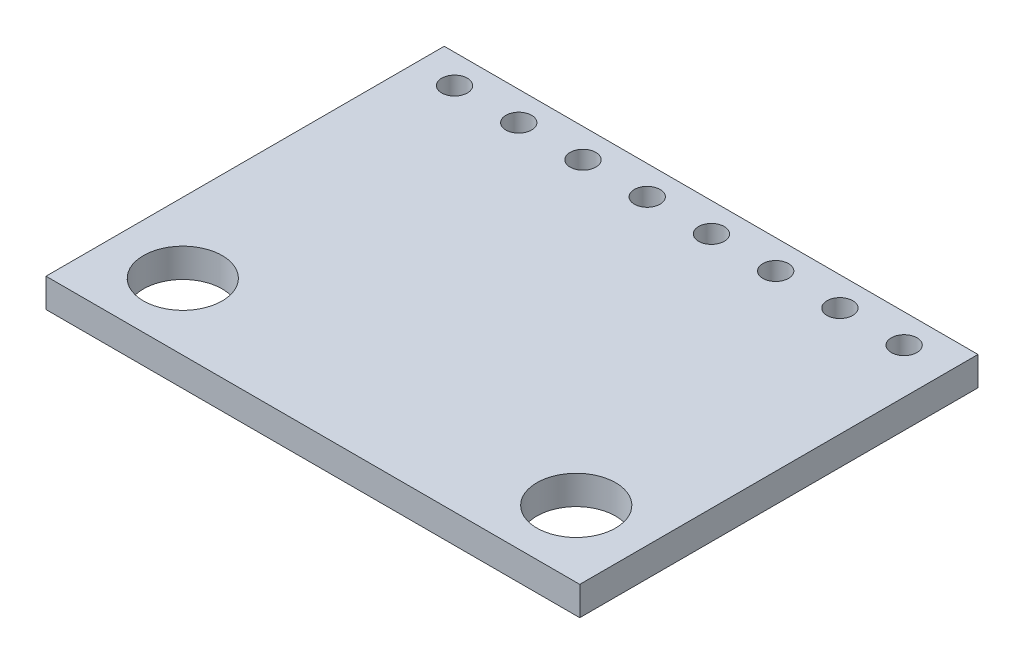
ISO-10303-21;
HEADER;
FILE_DESCRIPTION(('STEP AP214'),'2;1');
FILE_NAME('part.step','',(''),(''),'','','');
FILE_SCHEMA(('AUTOMOTIVE_DESIGN { 1 0 10303 214 1 1 1 1 }'));
ENDSEC;
DATA;
#1=APPLICATION_CONTEXT('core data for automotive mechanical design processes');
#2=APPLICATION_PROTOCOL_DEFINITION('international standard','automotive_design',2000,#1);
#3=PRODUCT_CONTEXT('',#1,'mechanical');
#4=PRODUCT('Part','Part','',(#3));
#5=PRODUCT_RELATED_PRODUCT_CATEGORY('part','',(#4));
#6=PRODUCT_DEFINITION_FORMATION('','',#4);
#7=PRODUCT_DEFINITION_CONTEXT('part definition',#1,'design');
#8=PRODUCT_DEFINITION('design','',#6,#7);
#9=PRODUCT_DEFINITION_SHAPE('','',#8);
#10=(LENGTH_UNIT() NAMED_UNIT(*) SI_UNIT(.MILLI.,.METRE.));
#11=(NAMED_UNIT(*) PLANE_ANGLE_UNIT() SI_UNIT($,.RADIAN.));
#12=(NAMED_UNIT(*) SI_UNIT($,.STERADIAN.) SOLID_ANGLE_UNIT());
#13=UNCERTAINTY_MEASURE_WITH_UNIT(LENGTH_MEASURE(1.E-05),#10,'distance_accuracy_value','');
#14=(GEOMETRIC_REPRESENTATION_CONTEXT(3) GLOBAL_UNCERTAINTY_ASSIGNED_CONTEXT((#13)) GLOBAL_UNIT_ASSIGNED_CONTEXT((#10,
#11,#12)) REPRESENTATION_CONTEXT('',''));
#15=CARTESIAN_POINT('',(0.,0.,0.));
#16=DIRECTION('',(0.,0.,1.));
#17=DIRECTION('',(1.,0.,0.));
#18=AXIS2_PLACEMENT_3D('',#15,#16,#17);
#19=CARTESIAN_POINT('',(0.,0.571499999999989,0.));
#20=DIRECTION('',(0.,-1.,0.));
#21=DIRECTION('',(0.,0.,-1.));
#22=AXIS2_PLACEMENT_3D('',#19,#20,#21);
#23=PLANE('',#22);
#24=CARTESIAN_POINT('',(6.2357,0.571499999999989,-6.73100000000001));
#25=DIRECTION('',(0.,1.,0.));
#26=DIRECTION('',(0.,0.,1.));
#27=AXIS2_PLACEMENT_3D('',#24,#25,#26);
#28=CIRCLE('',#27,0.508);
#29=CARTESIAN_POINT('',(6.2357,0.571499999999989,-6.22300000000001));
#30=VERTEX_POINT('',#29);
#31=EDGE_CURVE('E168',#30,#30,#28,.T.);
#32=ORIENTED_EDGE('',*,*,#31,.F.);
#33=EDGE_LOOP('',(#32));
#34=FACE_BOUND('',#33,.T.);
#35=CARTESIAN_POINT('',(1.1557,0.571499999999989,-6.73100000000001));
#36=DIRECTION('',(0.,1.,0.));
#37=DIRECTION('',(0.,0.,1.));
#38=AXIS2_PLACEMENT_3D('',#35,#36,#37);
#39=CIRCLE('',#38,0.508);
#40=CARTESIAN_POINT('',(1.1557,0.571499999999989,-6.22300000000001));
#41=VERTEX_POINT('',#40);
#42=EDGE_CURVE('E156',#41,#41,#39,.T.);
#43=ORIENTED_EDGE('',*,*,#42,.F.);
#44=EDGE_LOOP('',(#43));
#45=FACE_BOUND('',#44,.T.);
#46=CARTESIAN_POINT('',(-3.9243,0.571499999999989,-6.73100000000001));
#47=DIRECTION('',(0.,1.,0.));
#48=DIRECTION('',(0.,0.,1.));
#49=AXIS2_PLACEMENT_3D('',#46,#47,#48);
#50=CIRCLE('',#49,0.508);
#51=CARTESIAN_POINT('',(-3.9243,0.571499999999989,-6.22300000000001));
#52=VERTEX_POINT('',#51);
#53=EDGE_CURVE('E144',#52,#52,#50,.T.);
#54=ORIENTED_EDGE('',*,*,#53,.F.);
#55=EDGE_LOOP('',(#54));
#56=FACE_BOUND('',#55,.T.);
#57=CARTESIAN_POINT('',(-9.00429999999999,0.571499999999989,-6.73100000000001));
#58=DIRECTION('',(0.,1.,0.));
#59=DIRECTION('',(0.,0.,1.));
#60=AXIS2_PLACEMENT_3D('',#57,#58,#59);
#61=CIRCLE('',#60,0.508);
#62=CARTESIAN_POINT('',(-9.00429999999999,0.571499999999989,-6.22300000000001));
#63=VERTEX_POINT('',#62);
#64=EDGE_CURVE('E132',#63,#63,#61,.T.);
#65=ORIENTED_EDGE('',*,*,#64,.F.);
#66=EDGE_LOOP('',(#65));
#67=FACE_BOUND('',#66,.T.);
#68=CARTESIAN_POINT('',(-7.77874999999998,0.571499999999989,5.23874999999999));
#69=DIRECTION('',(0.,1.,0.));
#70=DIRECTION('',(0.,0.,1.));
#71=AXIS2_PLACEMENT_3D('',#68,#69,#70);
#72=CIRCLE('',#71,1.55575);
#73=CARTESIAN_POINT('',(-7.77874999999998,0.571499999999989,6.79449999999999));
#74=VERTEX_POINT('',#73);
#75=EDGE_CURVE('E111',#74,#74,#72,.T.);
#76=ORIENTED_EDGE('',*,*,#75,.F.);
#77=EDGE_LOOP('',(#76));
#78=FACE_BOUND('',#77,.T.);
#79=DIRECTION('',(0.,0.,-1.));
#80=VECTOR('',#79,1.);
#81=CARTESIAN_POINT('',(10.5537,0.571500000000003,7.87399999999998));
#82=LINE('',#81,#80);
#83=CARTESIAN_POINT('',(10.5537,0.571500000000003,7.87399999999998));
#84=VERTEX_POINT('',#83);
#85=CARTESIAN_POINT('',(10.5537,0.571499999999989,-7.87399999999999));
#86=VERTEX_POINT('',#85);
#87=EDGE_CURVE('E96',#84,#86,#82,.T.);
#88=ORIENTED_EDGE('',*,*,#87,.T.);
#89=DIRECTION('',(-1.,0.,0.));
#90=VECTOR('',#89,1.);
#91=CARTESIAN_POINT('',(-10.5537,0.571500000000003,-7.87400000000001));
#92=LINE('',#91,#90);
#93=CARTESIAN_POINT('',(-10.5537,0.571500000000003,-7.87400000000001));
#94=VERTEX_POINT('',#93);
#95=EDGE_CURVE('E91',#86,#94,#92,.T.);
#96=ORIENTED_EDGE('',*,*,#95,.T.);
#97=DIRECTION('',(0.,0.,1.));
#98=VECTOR('',#97,1.);
#99=CARTESIAN_POINT('',(-10.5537,0.571500000000003,7.87399999999998));
#100=LINE('',#99,#98);
#101=CARTESIAN_POINT('',(-10.5537,0.571500000000003,7.87399999999998));
#102=VERTEX_POINT('',#101);
#103=EDGE_CURVE('E94',#94,#102,#100,.T.);
#104=ORIENTED_EDGE('',*,*,#103,.T.);
#105=DIRECTION('',(1.,0.,0.));
#106=VECTOR('',#105,1.);
#107=CARTESIAN_POINT('',(-10.5537,0.571500000000003,7.87399999999998));
#108=LINE('',#107,#106);
#109=EDGE_CURVE('E61',#102,#84,#108,.T.);
#110=ORIENTED_EDGE('',*,*,#109,.T.);
#111=EDGE_LOOP('',(#88,#96,#104,#110));
#112=FACE_BOUND('',#111,.T.);
#113=CARTESIAN_POINT('',(7.77874999999999,0.571499999999989,5.23874999999999));
#114=DIRECTION('',(0.,1.,0.));
#115=DIRECTION('',(0.,0.,-1.));
#116=AXIS2_PLACEMENT_3D('',#113,#114,#115);
#117=CIRCLE('',#116,1.55575);
#118=CARTESIAN_POINT('',(7.77874999999999,0.571499999999989,3.68299999999999));
#119=VERTEX_POINT('',#118);
#120=EDGE_CURVE('E126',#119,#119,#117,.T.);
#121=ORIENTED_EDGE('',*,*,#120,.F.);
#122=EDGE_LOOP('',(#121));
#123=FACE_BOUND('',#122,.T.);
#124=CARTESIAN_POINT('',(-6.46429999999999,0.571499999999989,-6.73100000000001));
#125=DIRECTION('',(0.,1.,0.));
#126=DIRECTION('',(0.,0.,1.));
#127=AXIS2_PLACEMENT_3D('',#124,#125,#126);
#128=CIRCLE('',#127,0.508);
#129=CARTESIAN_POINT('',(-6.46429999999999,0.571499999999989,-6.22300000000001));
#130=VERTEX_POINT('',#129);
#131=EDGE_CURVE('E138',#130,#130,#128,.T.);
#132=ORIENTED_EDGE('',*,*,#131,.F.);
#133=EDGE_LOOP('',(#132));
#134=FACE_BOUND('',#133,.T.);
#135=CARTESIAN_POINT('',(-1.3843,0.571499999999989,-6.73100000000001));
#136=DIRECTION('',(0.,1.,0.));
#137=DIRECTION('',(0.,0.,1.));
#138=AXIS2_PLACEMENT_3D('',#135,#136,#137);
#139=CIRCLE('',#138,0.508);
#140=CARTESIAN_POINT('',(-1.3843,0.571499999999989,-6.22300000000001));
#141=VERTEX_POINT('',#140);
#142=EDGE_CURVE('E150',#141,#141,#139,.T.);
#143=ORIENTED_EDGE('',*,*,#142,.F.);
#144=EDGE_LOOP('',(#143));
#145=FACE_BOUND('',#144,.T.);
#146=CARTESIAN_POINT('',(3.6957,0.571499999999989,-6.73100000000001));
#147=DIRECTION('',(0.,1.,0.));
#148=DIRECTION('',(0.,0.,1.));
#149=AXIS2_PLACEMENT_3D('',#146,#147,#148);
#150=CIRCLE('',#149,0.508);
#151=CARTESIAN_POINT('',(3.6957,0.571499999999989,-6.22300000000001));
#152=VERTEX_POINT('',#151);
#153=EDGE_CURVE('E162',#152,#152,#150,.T.);
#154=ORIENTED_EDGE('',*,*,#153,.F.);
#155=EDGE_LOOP('',(#154));
#156=FACE_BOUND('',#155,.T.);
#157=CARTESIAN_POINT('',(8.7757,0.571499999999989,-6.73100000000001));
#158=DIRECTION('',(0.,1.,0.));
#159=DIRECTION('',(0.,0.,1.));
#160=AXIS2_PLACEMENT_3D('',#157,#158,#159);
#161=CIRCLE('',#160,0.508);
#162=CARTESIAN_POINT('',(8.7757,0.571499999999989,-6.22300000000001));
#163=VERTEX_POINT('',#162);
#164=EDGE_CURVE('E174',#163,#163,#161,.T.);
#165=ORIENTED_EDGE('',*,*,#164,.F.);
#166=EDGE_LOOP('',(#165));
#167=FACE_BOUND('',#166,.T.);
#168=ADVANCED_FACE('F44',(#34,#45,#56,#67,#78,#112,#123,#134,#145,#156,#167),#23,.F.);
#169=CARTESIAN_POINT('',(0.,-0.571500000000003,0.));
#170=DIRECTION('',(0.,-1.,0.));
#171=DIRECTION('',(0.,0.,-1.));
#172=AXIS2_PLACEMENT_3D('',#169,#170,#171);
#173=PLANE('',#172);
#174=CARTESIAN_POINT('',(6.2357,-0.571500000000003,-6.73100000000001));
#175=DIRECTION('',(0.,1.,0.));
#176=DIRECTION('',(0.,0.,1.));
#177=AXIS2_PLACEMENT_3D('',#174,#175,#176);
#178=CIRCLE('',#177,0.508);
#179=CARTESIAN_POINT('',(6.2357,-0.571500000000003,-6.22300000000001));
#180=VERTEX_POINT('',#179);
#181=EDGE_CURVE('E171',#180,#180,#178,.T.);
#182=ORIENTED_EDGE('',*,*,#181,.T.);
#183=EDGE_LOOP('',(#182));
#184=FACE_BOUND('',#183,.T.);
#185=CARTESIAN_POINT('',(1.1557,-0.571500000000003,-6.73100000000003));
#186=DIRECTION('',(0.,1.,0.));
#187=DIRECTION('',(0.,0.,1.));
#188=AXIS2_PLACEMENT_3D('',#185,#186,#187);
#189=CIRCLE('',#188,0.508);
#190=CARTESIAN_POINT('',(1.1557,-0.571500000000003,-6.22300000000003));
#191=VERTEX_POINT('',#190);
#192=EDGE_CURVE('E159',#191,#191,#189,.T.);
#193=ORIENTED_EDGE('',*,*,#192,.T.);
#194=EDGE_LOOP('',(#193));
#195=FACE_BOUND('',#194,.T.);
#196=CARTESIAN_POINT('',(-3.9243,-0.571500000000003,-6.73100000000003));
#197=DIRECTION('',(0.,1.,0.));
#198=DIRECTION('',(0.,0.,1.));
#199=AXIS2_PLACEMENT_3D('',#196,#197,#198);
#200=CIRCLE('',#199,0.508);
#201=CARTESIAN_POINT('',(-3.9243,-0.571500000000003,-6.22300000000003));
#202=VERTEX_POINT('',#201);
#203=EDGE_CURVE('E147',#202,#202,#200,.T.);
#204=ORIENTED_EDGE('',*,*,#203,.T.);
#205=EDGE_LOOP('',(#204));
#206=FACE_BOUND('',#205,.T.);
#207=CARTESIAN_POINT('',(-9.00429999999999,-0.571500000000003,-6.73100000000003));
#208=DIRECTION('',(0.,1.,0.));
#209=DIRECTION('',(0.,0.,1.));
#210=AXIS2_PLACEMENT_3D('',#207,#208,#209);
#211=CIRCLE('',#210,0.508);
#212=CARTESIAN_POINT('',(-9.00429999999999,-0.571500000000003,-6.22300000000003));
#213=VERTEX_POINT('',#212);
#214=EDGE_CURVE('E135',#213,#213,#211,.T.);
#215=ORIENTED_EDGE('',*,*,#214,.T.);
#216=EDGE_LOOP('',(#215));
#217=FACE_BOUND('',#216,.T.);
#218=CARTESIAN_POINT('',(-7.77874999999998,-0.571500000000003,5.23874999999997));
#219=DIRECTION('',(0.,1.,0.));
#220=DIRECTION('',(0.,0.,1.));
#221=AXIS2_PLACEMENT_3D('',#218,#219,#220);
#222=CIRCLE('',#221,1.55575);
#223=CARTESIAN_POINT('',(-7.77874999999998,-0.571500000000003,6.79449999999997));
#224=VERTEX_POINT('',#223);
#225=EDGE_CURVE('E123',#224,#224,#222,.T.);
#226=ORIENTED_EDGE('',*,*,#225,.T.);
#227=EDGE_LOOP('',(#226));
#228=FACE_BOUND('',#227,.T.);
#229=DIRECTION('',(0.,0.,-1.));
#230=VECTOR('',#229,1.);
#231=CARTESIAN_POINT('',(10.5537,-0.571500000000003,7.87399999999999));
#232=LINE('',#231,#230);
#233=CARTESIAN_POINT('',(10.5537,-0.571500000000003,7.87399999999999));
#234=VERTEX_POINT('',#233);
#235=CARTESIAN_POINT('',(10.5537,-0.571500000000016,-7.87400000000002));
#236=VERTEX_POINT('',#235);
#237=EDGE_CURVE('E108',#234,#236,#232,.T.);
#238=ORIENTED_EDGE('',*,*,#237,.F.);
#239=DIRECTION('',(1.,0.,0.));
#240=VECTOR('',#239,1.);
#241=CARTESIAN_POINT('',(-10.5537,-0.571500000000003,7.87399999999998));
#242=LINE('',#241,#240);
#243=CARTESIAN_POINT('',(-10.5537,-0.571500000000003,7.87399999999998));
#244=VERTEX_POINT('',#243);
#245=EDGE_CURVE('E84',#244,#234,#242,.T.);
#246=ORIENTED_EDGE('',*,*,#245,.F.);
#247=DIRECTION('',(0.,0.,1.));
#248=VECTOR('',#247,1.);
#249=CARTESIAN_POINT('',(-10.5537,-0.571500000000003,7.87399999999998));
#250=LINE('',#249,#248);
#251=CARTESIAN_POINT('',(-10.5537,-0.571500000000016,-7.87400000000003));
#252=VERTEX_POINT('',#251);
#253=EDGE_CURVE('E78',#252,#244,#250,.T.);
#254=ORIENTED_EDGE('',*,*,#253,.F.);
#255=DIRECTION('',(-1.,0.,0.));
#256=VECTOR('',#255,1.);
#257=CARTESIAN_POINT('',(-10.5537,-0.571500000000016,-7.87400000000003));
#258=LINE('',#257,#256);
#259=EDGE_CURVE('E100',#236,#252,#258,.T.);
#260=ORIENTED_EDGE('',*,*,#259,.F.);
#261=EDGE_LOOP('',(#238,#246,#254,#260));
#262=FACE_BOUND('',#261,.T.);
#263=CARTESIAN_POINT('',(7.77874999999999,-0.571500000000003,5.23874999999999));
#264=DIRECTION('',(0.,1.,0.));
#265=DIRECTION('',(0.,0.,-1.));
#266=AXIS2_PLACEMENT_3D('',#263,#264,#265);
#267=CIRCLE('',#266,1.55575);
#268=CARTESIAN_POINT('',(7.77874999999999,-0.571500000000003,3.68299999999999));
#269=VERTEX_POINT('',#268);
#270=EDGE_CURVE('E129',#269,#269,#267,.T.);
#271=ORIENTED_EDGE('',*,*,#270,.T.);
#272=EDGE_LOOP('',(#271));
#273=FACE_BOUND('',#272,.T.);
#274=CARTESIAN_POINT('',(-6.46429999999999,-0.571500000000003,-6.73100000000003));
#275=DIRECTION('',(0.,1.,0.));
#276=DIRECTION('',(0.,0.,1.));
#277=AXIS2_PLACEMENT_3D('',#274,#275,#276);
#278=CIRCLE('',#277,0.508);
#279=CARTESIAN_POINT('',(-6.46429999999999,-0.571500000000003,-6.22300000000003));
#280=VERTEX_POINT('',#279);
#281=EDGE_CURVE('E141',#280,#280,#278,.T.);
#282=ORIENTED_EDGE('',*,*,#281,.T.);
#283=EDGE_LOOP('',(#282));
#284=FACE_BOUND('',#283,.T.);
#285=CARTESIAN_POINT('',(-1.3843,-0.571500000000003,-6.73100000000003));
#286=DIRECTION('',(0.,1.,0.));
#287=DIRECTION('',(0.,0.,1.));
#288=AXIS2_PLACEMENT_3D('',#285,#286,#287);
#289=CIRCLE('',#288,0.508);
#290=CARTESIAN_POINT('',(-1.3843,-0.571500000000003,-6.22300000000003));
#291=VERTEX_POINT('',#290);
#292=EDGE_CURVE('E153',#291,#291,#289,.T.);
#293=ORIENTED_EDGE('',*,*,#292,.T.);
#294=EDGE_LOOP('',(#293));
#295=FACE_BOUND('',#294,.T.);
#296=CARTESIAN_POINT('',(3.6957,-0.571500000000003,-6.73100000000003));
#297=DIRECTION('',(0.,1.,0.));
#298=DIRECTION('',(0.,0.,1.));
#299=AXIS2_PLACEMENT_3D('',#296,#297,#298);
#300=CIRCLE('',#299,0.508);
#301=CARTESIAN_POINT('',(3.6957,-0.571500000000003,-6.22300000000003));
#302=VERTEX_POINT('',#301);
#303=EDGE_CURVE('E165',#302,#302,#300,.T.);
#304=ORIENTED_EDGE('',*,*,#303,.T.);
#305=EDGE_LOOP('',(#304));
#306=FACE_BOUND('',#305,.T.);
#307=CARTESIAN_POINT('',(8.7757,-0.571500000000003,-6.73100000000001));
#308=DIRECTION('',(0.,1.,0.));
#309=DIRECTION('',(0.,0.,1.));
#310=AXIS2_PLACEMENT_3D('',#307,#308,#309);
#311=CIRCLE('',#310,0.508);
#312=CARTESIAN_POINT('',(8.7757,-0.571500000000003,-6.22300000000001));
#313=VERTEX_POINT('',#312);
#314=EDGE_CURVE('E177',#313,#313,#311,.T.);
#315=ORIENTED_EDGE('',*,*,#314,.T.);
#316=EDGE_LOOP('',(#315));
#317=FACE_BOUND('',#316,.T.);
#318=ADVANCED_FACE('F119',(#184,#195,#206,#217,#228,#262,#273,#284,#295,#306,#317),#173,.T.);
#319=CARTESIAN_POINT('',(10.5537,0.571500000000003,7.87399999999998));
#320=DIRECTION('',(-1.,0.,0.));
#321=DIRECTION('',(0.,0.,1.));
#322=AXIS2_PLACEMENT_3D('',#319,#320,#321);
#323=PLANE('',#322);
#324=ORIENTED_EDGE('',*,*,#237,.T.);
#325=DIRECTION('',(0.,-1.,0.));
#326=VECTOR('',#325,1.);
#327=CARTESIAN_POINT('',(10.5537,0.571499999999989,-7.87399999999999));
#328=LINE('',#327,#326);
#329=EDGE_CURVE('E13',#86,#236,#328,.T.);
#330=ORIENTED_EDGE('',*,*,#329,.F.);
#331=ORIENTED_EDGE('',*,*,#87,.F.);
#332=DIRECTION('',(0.,-1.,0.));
#333=VECTOR('',#332,1.);
#334=CARTESIAN_POINT('',(10.5537,0.571500000000003,7.87399999999998));
#335=LINE('',#334,#333);
#336=EDGE_CURVE('E104',#84,#234,#335,.T.);
#337=ORIENTED_EDGE('',*,*,#336,.T.);
#338=EDGE_LOOP('',(#324,#330,#331,#337));
#339=FACE_BOUND('',#338,.T.);
#340=ADVANCED_FACE('F46',(#339),#323,.F.);
#341=CARTESIAN_POINT('',(-10.5537,0.571500000000003,-7.87400000000001));
#342=DIRECTION('',(0.,0.,1.));
#343=DIRECTION('',(1.,0.,0.));
#344=AXIS2_PLACEMENT_3D('',#341,#342,#343);
#345=PLANE('',#344);
#346=ORIENTED_EDGE('',*,*,#259,.T.);
#347=DIRECTION('',(0.,-1.,0.));
#348=VECTOR('',#347,1.);
#349=CARTESIAN_POINT('',(-10.5537,0.571500000000003,-7.87400000000001));
#350=LINE('',#349,#348);
#351=EDGE_CURVE('E53',#94,#252,#350,.T.);
#352=ORIENTED_EDGE('',*,*,#351,.F.);
#353=ORIENTED_EDGE('',*,*,#95,.F.);
#354=ORIENTED_EDGE('',*,*,#329,.T.);
#355=EDGE_LOOP('',(#346,#352,#353,#354));
#356=FACE_BOUND('',#355,.T.);
#357=ADVANCED_FACE('F99',(#356),#345,.F.);
#358=CARTESIAN_POINT('',(-10.5537,0.571500000000003,7.87399999999998));
#359=DIRECTION('',(1.,0.,0.));
#360=DIRECTION('',(0.,0.,-1.));
#361=AXIS2_PLACEMENT_3D('',#358,#359,#360);
#362=PLANE('',#361);
#363=ORIENTED_EDGE('',*,*,#253,.T.);
#364=DIRECTION('',(0.,-1.,0.));
#365=VECTOR('',#364,1.);
#366=CARTESIAN_POINT('',(-10.5537,0.571500000000003,7.87399999999998));
#367=LINE('',#366,#365);
#368=EDGE_CURVE('E101',#102,#244,#367,.T.);
#369=ORIENTED_EDGE('',*,*,#368,.F.);
#370=ORIENTED_EDGE('',*,*,#103,.F.);
#371=ORIENTED_EDGE('',*,*,#351,.T.);
#372=EDGE_LOOP('',(#363,#369,#370,#371));
#373=FACE_BOUND('',#372,.T.);
#374=ADVANCED_FACE('F102',(#373),#362,.F.);
#375=CARTESIAN_POINT('',(-10.5537,0.571500000000003,7.87399999999998));
#376=DIRECTION('',(0.,0.,-1.));
#377=DIRECTION('',(-1.,0.,0.));
#378=AXIS2_PLACEMENT_3D('',#375,#376,#377);
#379=PLANE('',#378);
#380=ORIENTED_EDGE('',*,*,#245,.T.);
#381=ORIENTED_EDGE('',*,*,#336,.F.);
#382=ORIENTED_EDGE('',*,*,#109,.F.);
#383=ORIENTED_EDGE('',*,*,#368,.T.);
#384=EDGE_LOOP('',(#380,#381,#382,#383));
#385=FACE_BOUND('',#384,.T.);
#386=ADVANCED_FACE('F116',(#385),#379,.F.);
#387=CARTESIAN_POINT('',(-7.77874999999998,0.571499999999989,5.23874999999999));
#388=DIRECTION('',(0.,-1.,0.));
#389=DIRECTION('',(0.,0.,-1.));
#390=AXIS2_PLACEMENT_3D('',#387,#388,#389);
#391=CYLINDRICAL_SURFACE('',#390,1.55575);
#392=ORIENTED_EDGE('',*,*,#75,.T.);
#393=EDGE_LOOP('',(#392));
#394=FACE_BOUND('',#393,.T.);
#395=ORIENTED_EDGE('',*,*,#225,.F.);
#396=EDGE_LOOP('',(#395));
#397=FACE_BOUND('',#396,.T.);
#398=ADVANCED_FACE('F197',(#394,#397),#391,.F.);
#399=CARTESIAN_POINT('',(7.77874999999999,0.571499999999989,5.23874999999999));
#400=DIRECTION('',(0.,-1.,0.));
#401=DIRECTION('',(0.,0.,-1.));
#402=AXIS2_PLACEMENT_3D('',#399,#400,#401);
#403=CYLINDRICAL_SURFACE('',#402,1.55575);
#404=ORIENTED_EDGE('',*,*,#120,.T.);
#405=EDGE_LOOP('',(#404));
#406=FACE_BOUND('',#405,.T.);
#407=ORIENTED_EDGE('',*,*,#270,.F.);
#408=EDGE_LOOP('',(#407));
#409=FACE_BOUND('',#408,.T.);
#410=ADVANCED_FACE('F221',(#406,#409),#403,.F.);
#411=CARTESIAN_POINT('',(-9.00429999999999,0.571499999999989,-6.73100000000001));
#412=DIRECTION('',(0.,-1.,0.));
#413=DIRECTION('',(0.,0.,-1.));
#414=AXIS2_PLACEMENT_3D('',#411,#412,#413);
#415=CYLINDRICAL_SURFACE('',#414,0.508);
#416=ORIENTED_EDGE('',*,*,#64,.T.);
#417=EDGE_LOOP('',(#416));
#418=FACE_BOUND('',#417,.T.);
#419=ORIENTED_EDGE('',*,*,#214,.F.);
#420=EDGE_LOOP('',(#419));
#421=FACE_BOUND('',#420,.T.);
#422=ADVANCED_FACE('F226',(#418,#421),#415,.F.);
#423=CARTESIAN_POINT('',(-6.46429999999999,0.571499999999989,-6.73100000000001));
#424=DIRECTION('',(0.,-1.,0.));
#425=DIRECTION('',(0.,0.,-1.));
#426=AXIS2_PLACEMENT_3D('',#423,#424,#425);
#427=CYLINDRICAL_SURFACE('',#426,0.508);
#428=ORIENTED_EDGE('',*,*,#131,.T.);
#429=EDGE_LOOP('',(#428));
#430=FACE_BOUND('',#429,.T.);
#431=ORIENTED_EDGE('',*,*,#281,.F.);
#432=EDGE_LOOP('',(#431));
#433=FACE_BOUND('',#432,.T.);
#434=ADVANCED_FACE('F244',(#430,#433),#427,.F.);
#435=CARTESIAN_POINT('',(-3.9243,0.571499999999989,-6.73100000000001));
#436=DIRECTION('',(0.,-1.,0.));
#437=DIRECTION('',(0.,0.,-1.));
#438=AXIS2_PLACEMENT_3D('',#435,#436,#437);
#439=CYLINDRICAL_SURFACE('',#438,0.508);
#440=ORIENTED_EDGE('',*,*,#53,.T.);
#441=EDGE_LOOP('',(#440));
#442=FACE_BOUND('',#441,.T.);
#443=ORIENTED_EDGE('',*,*,#203,.F.);
#444=EDGE_LOOP('',(#443));
#445=FACE_BOUND('',#444,.T.);
#446=ADVANCED_FACE('F254',(#442,#445),#439,.F.);
#447=CARTESIAN_POINT('',(-1.3843,0.571499999999989,-6.73100000000001));
#448=DIRECTION('',(0.,-1.,0.));
#449=DIRECTION('',(0.,0.,-1.));
#450=AXIS2_PLACEMENT_3D('',#447,#448,#449);
#451=CYLINDRICAL_SURFACE('',#450,0.508);
#452=ORIENTED_EDGE('',*,*,#142,.T.);
#453=EDGE_LOOP('',(#452));
#454=FACE_BOUND('',#453,.T.);
#455=ORIENTED_EDGE('',*,*,#292,.F.);
#456=EDGE_LOOP('',(#455));
#457=FACE_BOUND('',#456,.T.);
#458=ADVANCED_FACE('F264',(#454,#457),#451,.F.);
#459=CARTESIAN_POINT('',(1.1557,0.571499999999989,-6.73100000000001));
#460=DIRECTION('',(0.,-1.,0.));
#461=DIRECTION('',(0.,0.,-1.));
#462=AXIS2_PLACEMENT_3D('',#459,#460,#461);
#463=CYLINDRICAL_SURFACE('',#462,0.508);
#464=ORIENTED_EDGE('',*,*,#42,.T.);
#465=EDGE_LOOP('',(#464));
#466=FACE_BOUND('',#465,.T.);
#467=ORIENTED_EDGE('',*,*,#192,.F.);
#468=EDGE_LOOP('',(#467));
#469=FACE_BOUND('',#468,.T.);
#470=ADVANCED_FACE('F274',(#466,#469),#463,.F.);
#471=CARTESIAN_POINT('',(3.6957,0.571499999999989,-6.73100000000001));
#472=DIRECTION('',(0.,-1.,0.));
#473=DIRECTION('',(0.,0.,-1.));
#474=AXIS2_PLACEMENT_3D('',#471,#472,#473);
#475=CYLINDRICAL_SURFACE('',#474,0.508);
#476=ORIENTED_EDGE('',*,*,#153,.T.);
#477=EDGE_LOOP('',(#476));
#478=FACE_BOUND('',#477,.T.);
#479=ORIENTED_EDGE('',*,*,#303,.F.);
#480=EDGE_LOOP('',(#479));
#481=FACE_BOUND('',#480,.T.);
#482=ADVANCED_FACE('F284',(#478,#481),#475,.F.);
#483=CARTESIAN_POINT('',(6.2357,0.571499999999989,-6.73100000000001));
#484=DIRECTION('',(0.,-1.,0.));
#485=DIRECTION('',(0.,0.,-1.));
#486=AXIS2_PLACEMENT_3D('',#483,#484,#485);
#487=CYLINDRICAL_SURFACE('',#486,0.508);
#488=ORIENTED_EDGE('',*,*,#31,.T.);
#489=EDGE_LOOP('',(#488));
#490=FACE_BOUND('',#489,.T.);
#491=ORIENTED_EDGE('',*,*,#181,.F.);
#492=EDGE_LOOP('',(#491));
#493=FACE_BOUND('',#492,.T.);
#494=ADVANCED_FACE('F294',(#490,#493),#487,.F.);
#495=CARTESIAN_POINT('',(8.7757,0.571499999999989,-6.73100000000001));
#496=DIRECTION('',(0.,-1.,0.));
#497=DIRECTION('',(0.,0.,-1.));
#498=AXIS2_PLACEMENT_3D('',#495,#496,#497);
#499=CYLINDRICAL_SURFACE('',#498,0.508);
#500=ORIENTED_EDGE('',*,*,#164,.T.);
#501=EDGE_LOOP('',(#500));
#502=FACE_BOUND('',#501,.T.);
#503=ORIENTED_EDGE('',*,*,#314,.F.);
#504=EDGE_LOOP('',(#503));
#505=FACE_BOUND('',#504,.T.);
#506=ADVANCED_FACE('F183',(#502,#505),#499,.F.);
#507=CLOSED_SHELL('',(#168,#318,#340,#357,#374,#386,#398,#410,#422,#434,#446,#458,#470,#482,
#494,#506));
#508=MANIFOLD_SOLID_BREP('B2',#507);
#509=ADVANCED_BREP_SHAPE_REPRESENTATION('',(#18,#508),#14);
#510=SHAPE_DEFINITION_REPRESENTATION(#9,#509);
ENDSEC;
END-ISO-10303-21;
